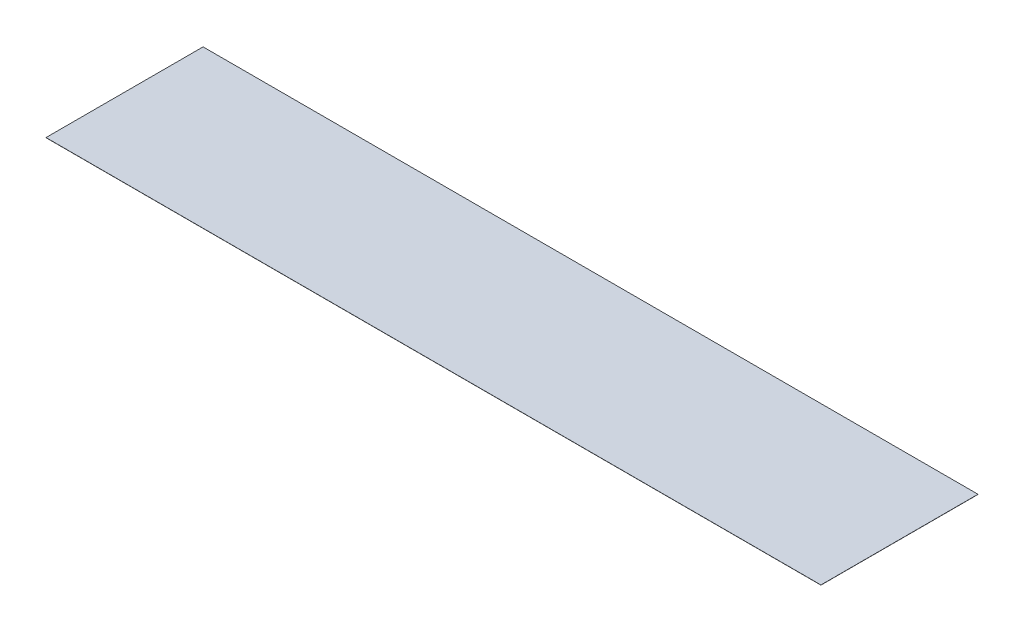
ISO-10303-21;
HEADER;
FILE_DESCRIPTION(('STEP AP214'),'2;1');
FILE_NAME('part.step','',(''),(''),'','','');
FILE_SCHEMA(('AUTOMOTIVE_DESIGN { 1 0 10303 214 1 1 1 1 }'));
ENDSEC;
DATA;
#1=APPLICATION_CONTEXT('core data for automotive mechanical design processes');
#2=APPLICATION_PROTOCOL_DEFINITION('international standard','automotive_design',2000,#1);
#3=PRODUCT_CONTEXT('',#1,'mechanical');
#4=PRODUCT('Part','Part','',(#3));
#5=PRODUCT_RELATED_PRODUCT_CATEGORY('part','',(#4));
#6=PRODUCT_DEFINITION_FORMATION('','',#4);
#7=PRODUCT_DEFINITION_CONTEXT('part definition',#1,'design');
#8=PRODUCT_DEFINITION('design','',#6,#7);
#9=PRODUCT_DEFINITION_SHAPE('','',#8);
#10=(LENGTH_UNIT() NAMED_UNIT(*) SI_UNIT(.MILLI.,.METRE.));
#11=(NAMED_UNIT(*) PLANE_ANGLE_UNIT() SI_UNIT($,.RADIAN.));
#12=(NAMED_UNIT(*) SI_UNIT($,.STERADIAN.) SOLID_ANGLE_UNIT());
#13=UNCERTAINTY_MEASURE_WITH_UNIT(LENGTH_MEASURE(1.E-05),#10,'distance_accuracy_value','');
#14=(GEOMETRIC_REPRESENTATION_CONTEXT(3) GLOBAL_UNCERTAINTY_ASSIGNED_CONTEXT((#13)) GLOBAL_UNIT_ASSIGNED_CONTEXT((#10,
#11,#12)) REPRESENTATION_CONTEXT('',''));
#15=CARTESIAN_POINT('',(0.,0.,0.));
#16=DIRECTION('',(0.,0.,1.));
#17=DIRECTION('',(1.,0.,0.));
#18=AXIS2_PLACEMENT_3D('',#15,#16,#17);
#19=CARTESIAN_POINT('',(0.,4.7752,0.));
#20=DIRECTION('',(1.,0.,0.));
#21=DIRECTION('',(0.,0.,-1.));
#22=AXIS2_PLACEMENT_3D('',#19,#20,#21);
#23=PLANE('',#22);
#24=DIRECTION('',(0.,0.,1.));
#25=VECTOR('',#24,1.);
#26=CARTESIAN_POINT('',(0.,0.,0.));
#27=LINE('',#26,#25);
#28=CARTESIAN_POINT('',(0.,0.,-4572.));
#29=VERTEX_POINT('',#28);
#30=CARTESIAN_POINT('',(0.,0.,0.));
#31=VERTEX_POINT('',#30);
#32=EDGE_CURVE('E106',#29,#31,#27,.T.);
#33=ORIENTED_EDGE('',*,*,#32,.T.);
#34=DIRECTION('',(0.,-1.,0.));
#35=VECTOR('',#34,1.);
#36=CARTESIAN_POINT('',(0.,4.7752,0.));
#37=LINE('',#36,#35);
#38=CARTESIAN_POINT('',(0.,4.7752,0.));
#39=VERTEX_POINT('',#38);
#40=EDGE_CURVE('E11',#39,#31,#37,.T.);
#41=ORIENTED_EDGE('',*,*,#40,.F.);
#42=DIRECTION('',(0.,0.,1.));
#43=VECTOR('',#42,1.);
#44=CARTESIAN_POINT('',(0.,4.7752,0.));
#45=LINE('',#44,#43);
#46=CARTESIAN_POINT('',(0.,4.7752,-4572.));
#47=VERTEX_POINT('',#46);
#48=EDGE_CURVE('E89',#47,#39,#45,.T.);
#49=ORIENTED_EDGE('',*,*,#48,.F.);
#50=DIRECTION('',(0.,-1.,0.));
#51=VECTOR('',#50,1.);
#52=CARTESIAN_POINT('',(0.,4.7752,-4572.));
#53=LINE('',#52,#51);
#54=EDGE_CURVE('E102',#47,#29,#53,.T.);
#55=ORIENTED_EDGE('',*,*,#54,.T.);
#56=EDGE_LOOP('',(#33,#41,#49,#55));
#57=FACE_BOUND('',#56,.T.);
#58=ADVANCED_FACE('F38',(#57),#23,.F.);
#59=CARTESIAN_POINT('',(0.,4.7752,0.));
#60=DIRECTION('',(0.,0.,-1.));
#61=DIRECTION('',(-1.,0.,0.));
#62=AXIS2_PLACEMENT_3D('',#59,#60,#61);
#63=PLANE('',#62);
#64=DIRECTION('',(1.,0.,0.));
#65=VECTOR('',#64,1.);
#66=CARTESIAN_POINT('',(0.,0.,0.));
#67=LINE('',#66,#65);
#68=CARTESIAN_POINT('',(22555.2,0.,0.));
#69=VERTEX_POINT('',#68);
#70=EDGE_CURVE('E94',#31,#69,#67,.T.);
#71=ORIENTED_EDGE('',*,*,#70,.T.);
#72=DIRECTION('',(0.,-1.,0.));
#73=VECTOR('',#72,1.);
#74=CARTESIAN_POINT('',(22555.2,4.7752,0.));
#75=LINE('',#74,#73);
#76=CARTESIAN_POINT('',(22555.2,4.7752,0.));
#77=VERTEX_POINT('',#76);
#78=EDGE_CURVE('E46',#77,#69,#75,.T.);
#79=ORIENTED_EDGE('',*,*,#78,.F.);
#80=DIRECTION('',(1.,0.,0.));
#81=VECTOR('',#80,1.);
#82=CARTESIAN_POINT('',(0.,4.7752,0.));
#83=LINE('',#82,#81);
#84=EDGE_CURVE('E84',#39,#77,#83,.T.);
#85=ORIENTED_EDGE('',*,*,#84,.F.);
#86=ORIENTED_EDGE('',*,*,#40,.T.);
#87=EDGE_LOOP('',(#71,#79,#85,#86));
#88=FACE_BOUND('',#87,.T.);
#89=ADVANCED_FACE('F93',(#88),#63,.F.);
#90=CARTESIAN_POINT('',(22555.2,4.7752,0.));
#91=DIRECTION('',(-1.,0.,0.));
#92=DIRECTION('',(0.,0.,1.));
#93=AXIS2_PLACEMENT_3D('',#90,#91,#92);
#94=PLANE('',#93);
#95=DIRECTION('',(0.,0.,-1.));
#96=VECTOR('',#95,1.);
#97=CARTESIAN_POINT('',(22555.2,0.,0.));
#98=LINE('',#97,#96);
#99=CARTESIAN_POINT('',(22555.2,0.,-4572.));
#100=VERTEX_POINT('',#99);
#101=EDGE_CURVE('E71',#69,#100,#98,.T.);
#102=ORIENTED_EDGE('',*,*,#101,.T.);
#103=DIRECTION('',(0.,-1.,0.));
#104=VECTOR('',#103,1.);
#105=CARTESIAN_POINT('',(22555.2,4.7752,-4572.));
#106=LINE('',#105,#104);
#107=CARTESIAN_POINT('',(22555.2,4.7752,-4572.));
#108=VERTEX_POINT('',#107);
#109=EDGE_CURVE('E95',#108,#100,#106,.T.);
#110=ORIENTED_EDGE('',*,*,#109,.F.);
#111=DIRECTION('',(0.,0.,-1.));
#112=VECTOR('',#111,1.);
#113=CARTESIAN_POINT('',(22555.2,4.7752,0.));
#114=LINE('',#113,#112);
#115=EDGE_CURVE('E87',#77,#108,#114,.T.);
#116=ORIENTED_EDGE('',*,*,#115,.F.);
#117=ORIENTED_EDGE('',*,*,#78,.T.);
#118=EDGE_LOOP('',(#102,#110,#116,#117));
#119=FACE_BOUND('',#118,.T.);
#120=ADVANCED_FACE('F96',(#119),#94,.F.);
#121=CARTESIAN_POINT('',(0.,4.7752,-4572.));
#122=DIRECTION('',(0.,0.,1.));
#123=DIRECTION('',(1.,0.,0.));
#124=AXIS2_PLACEMENT_3D('',#121,#122,#123);
#125=PLANE('',#124);
#126=DIRECTION('',(-1.,0.,0.));
#127=VECTOR('',#126,1.);
#128=CARTESIAN_POINT('',(0.,0.,-4572.));
#129=LINE('',#128,#127);
#130=EDGE_CURVE('E77',#100,#29,#129,.T.);
#131=ORIENTED_EDGE('',*,*,#130,.T.);
#132=ORIENTED_EDGE('',*,*,#54,.F.);
#133=DIRECTION('',(-1.,0.,0.));
#134=VECTOR('',#133,1.);
#135=CARTESIAN_POINT('',(0.,4.7752,-4572.));
#136=LINE('',#135,#134);
#137=EDGE_CURVE('E54',#108,#47,#136,.T.);
#138=ORIENTED_EDGE('',*,*,#137,.F.);
#139=ORIENTED_EDGE('',*,*,#109,.T.);
#140=EDGE_LOOP('',(#131,#132,#138,#139));
#141=FACE_BOUND('',#140,.T.);
#142=ADVANCED_FACE('F115',(#141),#125,.F.);
#143=CARTESIAN_POINT('',(0.,4.7752,0.));
#144=DIRECTION('',(0.,-1.,0.));
#145=DIRECTION('',(0.,0.,-1.));
#146=AXIS2_PLACEMENT_3D('',#143,#144,#145);
#147=PLANE('',#146);
#148=ORIENTED_EDGE('',*,*,#48,.T.);
#149=ORIENTED_EDGE('',*,*,#84,.T.);
#150=ORIENTED_EDGE('',*,*,#115,.T.);
#151=ORIENTED_EDGE('',*,*,#137,.T.);
#152=EDGE_LOOP('',(#148,#149,#150,#151));
#153=FACE_BOUND('',#152,.T.);
#154=ADVANCED_FACE('F85',(#153),#147,.F.);
#155=CARTESIAN_POINT('',(0.,0.,0.));
#156=DIRECTION('',(0.,-1.,0.));
#157=DIRECTION('',(0.,0.,-1.));
#158=AXIS2_PLACEMENT_3D('',#155,#156,#157);
#159=PLANE('',#158);
#160=ORIENTED_EDGE('',*,*,#32,.F.);
#161=ORIENTED_EDGE('',*,*,#130,.F.);
#162=ORIENTED_EDGE('',*,*,#101,.F.);
#163=ORIENTED_EDGE('',*,*,#70,.F.);
#164=EDGE_LOOP('',(#160,#161,#162,#163));
#165=FACE_BOUND('',#164,.T.);
#166=ADVANCED_FACE('F118',(#165),#159,.T.);
#167=CLOSED_SHELL('',(#58,#89,#120,#142,#154,#166));
#168=MANIFOLD_SOLID_BREP('B2',#167);
#169=ADVANCED_BREP_SHAPE_REPRESENTATION('',(#18,#168),#14);
#170=SHAPE_DEFINITION_REPRESENTATION(#9,#169);
ENDSEC;
END-ISO-10303-21;
